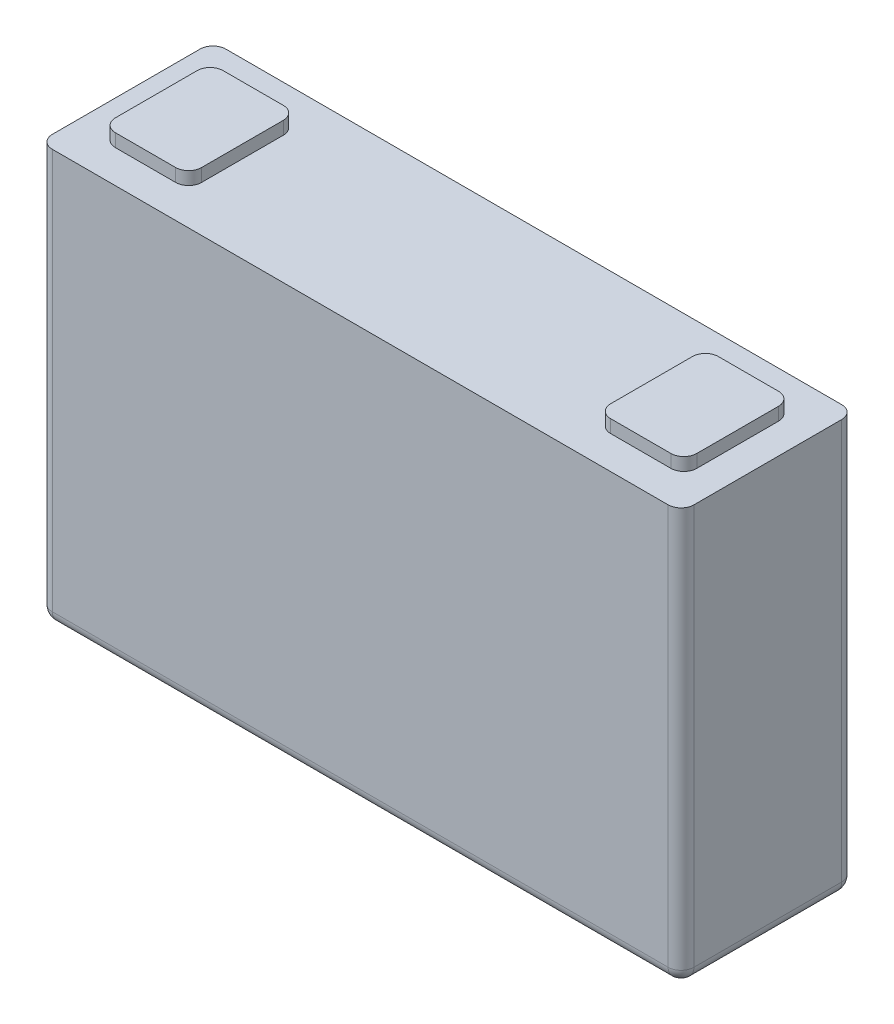
ISO-10303-21;
HEADER;
FILE_DESCRIPTION(('STEP AP214'),'2;1');
FILE_NAME('part.step','',(''),(''),'','','');
FILE_SCHEMA(('AUTOMOTIVE_DESIGN { 1 0 10303 214 1 1 1 1 }'));
ENDSEC;
DATA;
#1=APPLICATION_CONTEXT('core data for automotive mechanical design processes');
#2=APPLICATION_PROTOCOL_DEFINITION('international standard','automotive_design',2000,#1);
#3=PRODUCT_CONTEXT('',#1,'mechanical');
#4=PRODUCT('Part','Part','',(#3));
#5=PRODUCT_RELATED_PRODUCT_CATEGORY('part','',(#4));
#6=PRODUCT_DEFINITION_FORMATION('','',#4);
#7=PRODUCT_DEFINITION_CONTEXT('part definition',#1,'design');
#8=PRODUCT_DEFINITION('design','',#6,#7);
#9=PRODUCT_DEFINITION_SHAPE('','',#8);
#10=(LENGTH_UNIT() NAMED_UNIT(*) SI_UNIT(.MILLI.,.METRE.));
#11=(NAMED_UNIT(*) PLANE_ANGLE_UNIT() SI_UNIT($,.RADIAN.));
#12=(NAMED_UNIT(*) SI_UNIT($,.STERADIAN.) SOLID_ANGLE_UNIT());
#13=UNCERTAINTY_MEASURE_WITH_UNIT(LENGTH_MEASURE(1.E-05),#10,'distance_accuracy_value','');
#14=(GEOMETRIC_REPRESENTATION_CONTEXT(3) GLOBAL_UNCERTAINTY_ASSIGNED_CONTEXT((#13)) GLOBAL_UNIT_ASSIGNED_CONTEXT((#10,
#11,#12)) REPRESENTATION_CONTEXT('',''));
#15=CARTESIAN_POINT('',(0.,0.,0.));
#16=DIRECTION('',(0.,0.,1.));
#17=DIRECTION('',(1.,0.,0.));
#18=AXIS2_PLACEMENT_3D('',#15,#16,#17);
#19=CARTESIAN_POINT('',(-74.5,48.,20.15));
#20=DIRECTION('',(0.,-1.,0.));
#21=DIRECTION('',(1.,0.,0.));
#22=AXIS2_PLACEMENT_3D('',#19,#20,#21);
#23=PLANE('',#22);
#24=DIRECTION('',(0.,0.,1.));
#25=VECTOR('',#24,1.);
#26=CARTESIAN_POINT('',(-67.5,48.,20.15));
#27=LINE('',#26,#25);
#28=CARTESIAN_POINT('',(-67.5,48.,-9.5));
#29=VERTEX_POINT('',#28);
#30=CARTESIAN_POINT('',(-67.5,48.,9.5));
#31=VERTEX_POINT('',#30);
#32=EDGE_CURVE('E258',#29,#31,#27,.T.);
#33=ORIENTED_EDGE('',*,*,#32,.F.);
#34=CARTESIAN_POINT('',(-64.5,48.,-9.5));
#35=DIRECTION('',(0.,-1.,0.));
#36=DIRECTION('',(1.,0.,0.));
#37=AXIS2_PLACEMENT_3D('',#34,#35,#36);
#38=CIRCLE('',#37,3.);
#39=CARTESIAN_POINT('',(-64.5,48.,-12.5));
#40=VERTEX_POINT('',#39);
#41=EDGE_CURVE('E11',#29,#40,#38,.T.);
#42=ORIENTED_EDGE('',*,*,#41,.T.);
#43=DIRECTION('',(-1.,0.,0.));
#44=VECTOR('',#43,1.);
#45=CARTESIAN_POINT('',(-74.5,48.,-12.5));
#46=LINE('',#45,#44);
#47=CARTESIAN_POINT('',(-50.5,48.,-12.5));
#48=VERTEX_POINT('',#47);
#49=EDGE_CURVE('E250',#48,#40,#46,.T.);
#50=ORIENTED_EDGE('',*,*,#49,.F.);
#51=CARTESIAN_POINT('',(-50.5,48.,-9.5));
#52=DIRECTION('',(0.,-1.,0.));
#53=DIRECTION('',(1.,0.,0.));
#54=AXIS2_PLACEMENT_3D('',#51,#52,#53);
#55=CIRCLE('',#54,3.);
#56=CARTESIAN_POINT('',(-47.5,48.,-9.5));
#57=VERTEX_POINT('',#56);
#58=EDGE_CURVE('E44',#48,#57,#55,.T.);
#59=ORIENTED_EDGE('',*,*,#58,.T.);
#60=DIRECTION('',(0.,0.,-1.));
#61=VECTOR('',#60,1.);
#62=CARTESIAN_POINT('',(-47.5,48.,20.15));
#63=LINE('',#62,#61);
#64=CARTESIAN_POINT('',(-47.5,48.,9.5));
#65=VERTEX_POINT('',#64);
#66=EDGE_CURVE('E252',#65,#57,#63,.T.);
#67=ORIENTED_EDGE('',*,*,#66,.F.);
#68=CARTESIAN_POINT('',(-50.5,48.,9.5));
#69=DIRECTION('',(0.,-1.,0.));
#70=DIRECTION('',(1.,0.,0.));
#71=AXIS2_PLACEMENT_3D('',#68,#69,#70);
#72=CIRCLE('',#71,3.);
#73=CARTESIAN_POINT('',(-50.5,48.,12.5));
#74=VERTEX_POINT('',#73);
#75=EDGE_CURVE('E402',#65,#74,#72,.T.);
#76=ORIENTED_EDGE('',*,*,#75,.T.);
#77=DIRECTION('',(1.,0.,0.));
#78=VECTOR('',#77,1.);
#79=CARTESIAN_POINT('',(-74.5,48.,12.5));
#80=LINE('',#79,#78);
#81=CARTESIAN_POINT('',(-64.5,48.,12.5));
#82=VERTEX_POINT('',#81);
#83=EDGE_CURVE('E255',#82,#74,#80,.T.);
#84=ORIENTED_EDGE('',*,*,#83,.F.);
#85=CARTESIAN_POINT('',(-64.5,48.,9.5));
#86=DIRECTION('',(0.,-1.,0.));
#87=DIRECTION('',(1.,0.,0.));
#88=AXIS2_PLACEMENT_3D('',#85,#86,#87);
#89=CIRCLE('',#88,3.);
#90=EDGE_CURVE('E400',#82,#31,#89,.T.);
#91=ORIENTED_EDGE('',*,*,#90,.T.);
#92=EDGE_LOOP('',(#33,#42,#50,#59,#67,#76,#84,#91));
#93=FACE_BOUND('',#92,.T.);
#94=DIRECTION('',(0.,0.,-1.));
#95=VECTOR('',#94,1.);
#96=CARTESIAN_POINT('',(-74.5,48.,20.15));
#97=LINE('',#96,#95);
#98=CARTESIAN_POINT('',(-74.5,48.,17.15));
#99=VERTEX_POINT('',#98);
#100=CARTESIAN_POINT('',(-74.5,48.,-17.15));
#101=VERTEX_POINT('',#100);
#102=EDGE_CURVE('E237',#99,#101,#97,.T.);
#103=ORIENTED_EDGE('',*,*,#102,.F.);
#104=CARTESIAN_POINT('',(-71.5,48.,17.15));
#105=DIRECTION('',(0.,-1.,0.));
#106=DIRECTION('',(1.,0.,0.));
#107=AXIS2_PLACEMENT_3D('',#104,#105,#106);
#108=CIRCLE('',#107,3.);
#109=CARTESIAN_POINT('',(-71.5,48.,20.15));
#110=VERTEX_POINT('',#109);
#111=EDGE_CURVE('E236',#99,#110,#108,.F.);
#112=ORIENTED_EDGE('',*,*,#111,.T.);
#113=DIRECTION('',(-1.,0.,0.));
#114=VECTOR('',#113,1.);
#115=CARTESIAN_POINT('',(-74.5,48.,20.15));
#116=LINE('',#115,#114);
#117=CARTESIAN_POINT('',(71.5,48.,20.15));
#118=VERTEX_POINT('',#117);
#119=EDGE_CURVE('E213',#118,#110,#116,.T.);
#120=ORIENTED_EDGE('',*,*,#119,.F.);
#121=CARTESIAN_POINT('',(71.5,48.,17.15));
#122=DIRECTION('',(0.,-1.,0.));
#123=DIRECTION('',(1.,0.,0.));
#124=AXIS2_PLACEMENT_3D('',#121,#122,#123);
#125=CIRCLE('',#124,3.);
#126=CARTESIAN_POINT('',(74.5,48.,17.15));
#127=VERTEX_POINT('',#126);
#128=EDGE_CURVE('E223',#118,#127,#125,.F.);
#129=ORIENTED_EDGE('',*,*,#128,.T.);
#130=DIRECTION('',(0.,0.,-1.));
#131=VECTOR('',#130,1.);
#132=CARTESIAN_POINT('',(74.5,48.,20.15));
#133=LINE('',#132,#131);
#134=CARTESIAN_POINT('',(74.5,48.,-17.15));
#135=VERTEX_POINT('',#134);
#136=EDGE_CURVE('E241',#127,#135,#133,.T.);
#137=ORIENTED_EDGE('',*,*,#136,.T.);
#138=CARTESIAN_POINT('',(71.5,48.,-17.15));
#139=DIRECTION('',(0.,-1.,0.));
#140=DIRECTION('',(1.,0.,0.));
#141=AXIS2_PLACEMENT_3D('',#138,#139,#140);
#142=CIRCLE('',#141,3.);
#143=CARTESIAN_POINT('',(71.5,48.,-20.15));
#144=VERTEX_POINT('',#143);
#145=EDGE_CURVE('E230',#135,#144,#142,.F.);
#146=ORIENTED_EDGE('',*,*,#145,.T.);
#147=DIRECTION('',(-1.,0.,0.));
#148=VECTOR('',#147,1.);
#149=CARTESIAN_POINT('',(-74.5,48.,-20.15));
#150=LINE('',#149,#148);
#151=CARTESIAN_POINT('',(-71.5,48.,-20.15));
#152=VERTEX_POINT('',#151);
#153=EDGE_CURVE('E238',#144,#152,#150,.T.);
#154=ORIENTED_EDGE('',*,*,#153,.T.);
#155=CARTESIAN_POINT('',(-71.5,48.,-17.15));
#156=DIRECTION('',(0.,-1.,0.));
#157=DIRECTION('',(1.,0.,0.));
#158=AXIS2_PLACEMENT_3D('',#155,#156,#157);
#159=CIRCLE('',#158,3.);
#160=EDGE_CURVE('E278',#152,#101,#159,.F.);
#161=ORIENTED_EDGE('',*,*,#160,.T.);
#162=EDGE_LOOP('',(#103,#112,#120,#129,#137,#146,#154,#161));
#163=FACE_BOUND('',#162,.T.);
#164=DIRECTION('',(0.,0.,-1.));
#165=VECTOR('',#164,1.);
#166=CARTESIAN_POINT('',(67.5,48.,20.15));
#167=LINE('',#166,#165);
#168=CARTESIAN_POINT('',(67.5,48.,9.5));
#169=VERTEX_POINT('',#168);
#170=CARTESIAN_POINT('',(67.5,48.,-9.5));
#171=VERTEX_POINT('',#170);
#172=EDGE_CURVE('E220',#169,#171,#167,.T.);
#173=ORIENTED_EDGE('',*,*,#172,.F.);
#174=CARTESIAN_POINT('',(64.5,48.,9.5));
#175=DIRECTION('',(0.,-1.,0.));
#176=DIRECTION('',(1.,0.,0.));
#177=AXIS2_PLACEMENT_3D('',#174,#175,#176);
#178=CIRCLE('',#177,3.);
#179=CARTESIAN_POINT('',(64.5,48.,12.5));
#180=VERTEX_POINT('',#179);
#181=EDGE_CURVE('E398',#169,#180,#178,.T.);
#182=ORIENTED_EDGE('',*,*,#181,.T.);
#183=DIRECTION('',(1.,0.,0.));
#184=VECTOR('',#183,1.);
#185=CARTESIAN_POINT('',(-74.5,48.,12.5));
#186=LINE('',#185,#184);
#187=CARTESIAN_POINT('',(50.5,48.,12.5));
#188=VERTEX_POINT('',#187);
#189=EDGE_CURVE('E261',#188,#180,#186,.T.);
#190=ORIENTED_EDGE('',*,*,#189,.F.);
#191=CARTESIAN_POINT('',(50.5,48.,9.5));
#192=DIRECTION('',(0.,-1.,0.));
#193=DIRECTION('',(1.,0.,0.));
#194=AXIS2_PLACEMENT_3D('',#191,#192,#193);
#195=CIRCLE('',#194,3.);
#196=CARTESIAN_POINT('',(47.5,48.,9.5));
#197=VERTEX_POINT('',#196);
#198=EDGE_CURVE('E394',#188,#197,#195,.T.);
#199=ORIENTED_EDGE('',*,*,#198,.T.);
#200=DIRECTION('',(0.,0.,1.));
#201=VECTOR('',#200,1.);
#202=CARTESIAN_POINT('',(47.5,48.,20.15));
#203=LINE('',#202,#201);
#204=CARTESIAN_POINT('',(47.5,48.,-9.5));
#205=VERTEX_POINT('',#204);
#206=EDGE_CURVE('E264',#205,#197,#203,.T.);
#207=ORIENTED_EDGE('',*,*,#206,.F.);
#208=CARTESIAN_POINT('',(50.5,48.,-9.5));
#209=DIRECTION('',(0.,-1.,0.));
#210=DIRECTION('',(1.,0.,0.));
#211=AXIS2_PLACEMENT_3D('',#208,#209,#210);
#212=CIRCLE('',#211,3.);
#213=CARTESIAN_POINT('',(50.5,48.,-12.5));
#214=VERTEX_POINT('',#213);
#215=EDGE_CURVE('E392',#205,#214,#212,.T.);
#216=ORIENTED_EDGE('',*,*,#215,.T.);
#217=DIRECTION('',(-1.,0.,0.));
#218=VECTOR('',#217,1.);
#219=CARTESIAN_POINT('',(-74.5,48.,-12.5));
#220=LINE('',#219,#218);
#221=CARTESIAN_POINT('',(64.5,48.,-12.5));
#222=VERTEX_POINT('',#221);
#223=EDGE_CURVE('E267',#222,#214,#220,.T.);
#224=ORIENTED_EDGE('',*,*,#223,.F.);
#225=CARTESIAN_POINT('',(64.5,48.,-9.5));
#226=DIRECTION('',(0.,-1.,0.));
#227=DIRECTION('',(1.,0.,0.));
#228=AXIS2_PLACEMENT_3D('',#225,#226,#227);
#229=CIRCLE('',#228,3.);
#230=EDGE_CURVE('E396',#222,#171,#229,.T.);
#231=ORIENTED_EDGE('',*,*,#230,.T.);
#232=EDGE_LOOP('',(#173,#182,#190,#199,#207,#216,#224,#231));
#233=FACE_BOUND('',#232,.T.);
#234=ADVANCED_FACE('F36',(#93,#163,#233),#23,.F.);
#235=CARTESIAN_POINT('',(-74.5,48.,20.15));
#236=DIRECTION('',(1.,0.,0.));
#237=DIRECTION('',(0.,1.,0.));
#238=AXIS2_PLACEMENT_3D('',#235,#236,#237);
#239=PLANE('',#238);
#240=DIRECTION('',(0.,-1.,0.));
#241=VECTOR('',#240,1.);
#242=CARTESIAN_POINT('',(-74.5,48.,-17.15));
#243=LINE('',#242,#241);
#244=CARTESIAN_POINT('',(-74.5,-45.,-17.15));
#245=VERTEX_POINT('',#244);
#246=EDGE_CURVE('E273',#101,#245,#243,.T.);
#247=ORIENTED_EDGE('',*,*,#246,.T.);
#248=DIRECTION('',(0.,0.,-1.));
#249=VECTOR('',#248,1.);
#250=CARTESIAN_POINT('',(-74.5,-45.,20.15));
#251=LINE('',#250,#249);
#252=CARTESIAN_POINT('',(-74.5,-45.,17.15));
#253=VERTEX_POINT('',#252);
#254=EDGE_CURVE('E312',#245,#253,#251,.F.);
#255=ORIENTED_EDGE('',*,*,#254,.T.);
#256=DIRECTION('',(0.,-1.,0.));
#257=VECTOR('',#256,1.);
#258=CARTESIAN_POINT('',(-74.5,48.,17.15));
#259=LINE('',#258,#257);
#260=EDGE_CURVE('E231',#253,#99,#259,.F.);
#261=ORIENTED_EDGE('',*,*,#260,.T.);
#262=ORIENTED_EDGE('',*,*,#102,.T.);
#263=EDGE_LOOP('',(#247,#255,#261,#262));
#264=FACE_BOUND('',#263,.T.);
#265=ADVANCED_FACE('F484',(#264),#239,.F.);
#266=CARTESIAN_POINT('',(-74.5,-48.,20.15));
#267=DIRECTION('',(0.,1.,0.));
#268=DIRECTION('',(-1.,0.,0.));
#269=AXIS2_PLACEMENT_3D('',#266,#267,#268);
#270=PLANE('',#269);
#271=DIRECTION('',(0.,0.,-1.));
#272=VECTOR('',#271,1.);
#273=CARTESIAN_POINT('',(71.5,-48.,20.15));
#274=LINE('',#273,#272);
#275=CARTESIAN_POINT('',(71.5,-48.,-17.15));
#276=VERTEX_POINT('',#275);
#277=CARTESIAN_POINT('',(71.5,-48.,17.15));
#278=VERTEX_POINT('',#277);
#279=EDGE_CURVE('E297',#276,#278,#274,.F.);
#280=ORIENTED_EDGE('',*,*,#279,.T.);
#281=DIRECTION('',(1.,0.,0.));
#282=VECTOR('',#281,1.);
#283=CARTESIAN_POINT('',(-71.5,-48.,17.15));
#284=LINE('',#283,#282);
#285=CARTESIAN_POINT('',(-71.5,-48.,17.15));
#286=VERTEX_POINT('',#285);
#287=EDGE_CURVE('E299',#278,#286,#284,.F.);
#288=ORIENTED_EDGE('',*,*,#287,.T.);
#289=DIRECTION('',(0.,0.,-1.));
#290=VECTOR('',#289,1.);
#291=CARTESIAN_POINT('',(-71.5,-48.,20.15));
#292=LINE('',#291,#290);
#293=CARTESIAN_POINT('',(-71.5,-48.,-17.15));
#294=VERTEX_POINT('',#293);
#295=EDGE_CURVE('E293',#286,#294,#292,.T.);
#296=ORIENTED_EDGE('',*,*,#295,.T.);
#297=DIRECTION('',(1.,0.,0.));
#298=VECTOR('',#297,1.);
#299=CARTESIAN_POINT('',(-74.5,-48.,-17.15));
#300=LINE('',#299,#298);
#301=EDGE_CURVE('E295',#294,#276,#300,.T.);
#302=ORIENTED_EDGE('',*,*,#301,.T.);
#303=EDGE_LOOP('',(#280,#288,#296,#302));
#304=FACE_BOUND('',#303,.T.);
#305=ADVANCED_FACE('F489',(#304),#270,.F.);
#306=CARTESIAN_POINT('',(74.5,48.,20.15));
#307=DIRECTION('',(-1.,0.,0.));
#308=DIRECTION('',(0.,-1.,0.));
#309=AXIS2_PLACEMENT_3D('',#306,#307,#308);
#310=PLANE('',#309);
#311=DIRECTION('',(0.,1.,0.));
#312=VECTOR('',#311,1.);
#313=CARTESIAN_POINT('',(74.5,-48.,17.15));
#314=LINE('',#313,#312);
#315=CARTESIAN_POINT('',(74.5,-45.,17.15));
#316=VERTEX_POINT('',#315);
#317=EDGE_CURVE('E226',#127,#316,#314,.F.);
#318=ORIENTED_EDGE('',*,*,#317,.T.);
#319=DIRECTION('',(0.,0.,-1.));
#320=VECTOR('',#319,1.);
#321=CARTESIAN_POINT('',(74.5,-45.,20.15));
#322=LINE('',#321,#320);
#323=CARTESIAN_POINT('',(74.5,-45.,-17.15));
#324=VERTEX_POINT('',#323);
#325=EDGE_CURVE('E304',#316,#324,#322,.T.);
#326=ORIENTED_EDGE('',*,*,#325,.T.);
#327=DIRECTION('',(0.,1.,0.));
#328=VECTOR('',#327,1.);
#329=CARTESIAN_POINT('',(74.5,48.,-17.15));
#330=LINE('',#329,#328);
#331=EDGE_CURVE('E287',#324,#135,#330,.T.);
#332=ORIENTED_EDGE('',*,*,#331,.T.);
#333=ORIENTED_EDGE('',*,*,#136,.F.);
#334=EDGE_LOOP('',(#318,#326,#332,#333));
#335=FACE_BOUND('',#334,.T.);
#336=ADVANCED_FACE('F496',(#335),#310,.F.);
#337=CARTESIAN_POINT('',(0.,0.,20.15));
#338=DIRECTION('',(0.,0.,1.));
#339=DIRECTION('',(1.,0.,0.));
#340=AXIS2_PLACEMENT_3D('',#337,#338,#339);
#341=PLANE('',#340);
#342=DIRECTION('',(0.,-1.,0.));
#343=VECTOR('',#342,1.);
#344=CARTESIAN_POINT('',(-71.5,-48.,20.15));
#345=LINE('',#344,#343);
#346=CARTESIAN_POINT('',(-71.5,-45.,20.15));
#347=VERTEX_POINT('',#346);
#348=EDGE_CURVE('E219',#110,#347,#345,.T.);
#349=ORIENTED_EDGE('',*,*,#348,.T.);
#350=DIRECTION('',(1.,0.,0.));
#351=VECTOR('',#350,1.);
#352=CARTESIAN_POINT('',(71.5,-45.,20.15));
#353=LINE('',#352,#351);
#354=CARTESIAN_POINT('',(71.5,-45.,20.15));
#355=VERTEX_POINT('',#354);
#356=EDGE_CURVE('E216',#347,#355,#353,.T.);
#357=ORIENTED_EDGE('',*,*,#356,.T.);
#358=DIRECTION('',(0.,1.,0.));
#359=VECTOR('',#358,1.);
#360=CARTESIAN_POINT('',(71.5,48.,20.15));
#361=LINE('',#360,#359);
#362=EDGE_CURVE('E208',#355,#118,#361,.T.);
#363=ORIENTED_EDGE('',*,*,#362,.T.);
#364=ORIENTED_EDGE('',*,*,#119,.T.);
#365=EDGE_LOOP('',(#349,#357,#363,#364));
#366=FACE_BOUND('',#365,.T.);
#367=ADVANCED_FACE('F211',(#366),#341,.T.);
#368=CARTESIAN_POINT('',(0.,0.,-20.15));
#369=DIRECTION('',(0.,0.,1.));
#370=DIRECTION('',(1.,0.,0.));
#371=AXIS2_PLACEMENT_3D('',#368,#369,#370);
#372=PLANE('',#371);
#373=DIRECTION('',(0.,1.,0.));
#374=VECTOR('',#373,1.);
#375=CARTESIAN_POINT('',(71.5,0.,-20.15));
#376=LINE('',#375,#374);
#377=CARTESIAN_POINT('',(71.5,-45.,-20.15));
#378=VERTEX_POINT('',#377);
#379=EDGE_CURVE('E281',#144,#378,#376,.F.);
#380=ORIENTED_EDGE('',*,*,#379,.T.);
#381=DIRECTION('',(1.,0.,0.));
#382=VECTOR('',#381,1.);
#383=CARTESIAN_POINT('',(0.,-45.,-20.15));
#384=LINE('',#383,#382);
#385=CARTESIAN_POINT('',(-71.5,-45.,-20.15));
#386=VERTEX_POINT('',#385);
#387=EDGE_CURVE('E308',#378,#386,#384,.F.);
#388=ORIENTED_EDGE('',*,*,#387,.T.);
#389=DIRECTION('',(0.,-1.,0.));
#390=VECTOR('',#389,1.);
#391=CARTESIAN_POINT('',(-71.5,0.,-20.15));
#392=LINE('',#391,#390);
#393=EDGE_CURVE('E284',#386,#152,#392,.F.);
#394=ORIENTED_EDGE('',*,*,#393,.T.);
#395=ORIENTED_EDGE('',*,*,#153,.F.);
#396=EDGE_LOOP('',(#380,#388,#394,#395));
#397=FACE_BOUND('',#396,.T.);
#398=ADVANCED_FACE('F494',(#397),#372,.F.);
#399=CARTESIAN_POINT('',(-67.5,51.,-12.5));
#400=DIRECTION('',(1.,0.,0.));
#401=DIRECTION('',(0.,1.,0.));
#402=AXIS2_PLACEMENT_3D('',#399,#400,#401);
#403=PLANE('',#402);
#404=ORIENTED_EDGE('',*,*,#32,.T.);
#405=DIRECTION('',(0.,-1.,0.));
#406=VECTOR('',#405,1.);
#407=CARTESIAN_POINT('',(-67.5,51.,9.5));
#408=LINE('',#407,#406);
#409=CARTESIAN_POINT('',(-67.5,51.,9.5));
#410=VERTEX_POINT('',#409);
#411=EDGE_CURVE('E373',#31,#410,#408,.F.);
#412=ORIENTED_EDGE('',*,*,#411,.T.);
#413=DIRECTION('',(0.,0.,1.));
#414=VECTOR('',#413,1.);
#415=CARTESIAN_POINT('',(-67.5,51.,-12.5));
#416=LINE('',#415,#414);
#417=CARTESIAN_POINT('',(-67.5,51.,-9.5));
#418=VERTEX_POINT('',#417);
#419=EDGE_CURVE('E423',#418,#410,#416,.T.);
#420=ORIENTED_EDGE('',*,*,#419,.F.);
#421=DIRECTION('',(0.,-1.,0.));
#422=VECTOR('',#421,1.);
#423=CARTESIAN_POINT('',(-67.5,51.,-9.5));
#424=LINE('',#423,#422);
#425=EDGE_CURVE('E370',#418,#29,#424,.T.);
#426=ORIENTED_EDGE('',*,*,#425,.T.);
#427=EDGE_LOOP('',(#404,#412,#420,#426));
#428=FACE_BOUND('',#427,.T.);
#429=ADVANCED_FACE('F575',(#428),#403,.F.);
#430=CARTESIAN_POINT('',(-67.5,51.,12.5));
#431=DIRECTION('',(0.,0.,-1.));
#432=DIRECTION('',(-1.,0.,0.));
#433=AXIS2_PLACEMENT_3D('',#430,#431,#432);
#434=PLANE('',#433);
#435=DIRECTION('',(1.,0.,0.));
#436=VECTOR('',#435,1.);
#437=CARTESIAN_POINT('',(-67.5,51.,12.5));
#438=LINE('',#437,#436);
#439=CARTESIAN_POINT('',(-64.5,51.,12.5));
#440=VERTEX_POINT('',#439);
#441=CARTESIAN_POINT('',(-50.5,51.,12.5));
#442=VERTEX_POINT('',#441);
#443=EDGE_CURVE('E421',#440,#442,#438,.T.);
#444=ORIENTED_EDGE('',*,*,#443,.F.);
#445=DIRECTION('',(0.,-1.,0.));
#446=VECTOR('',#445,1.);
#447=CARTESIAN_POINT('',(-64.5,51.,12.5));
#448=LINE('',#447,#446);
#449=EDGE_CURVE('E367',#440,#82,#448,.T.);
#450=ORIENTED_EDGE('',*,*,#449,.T.);
#451=ORIENTED_EDGE('',*,*,#83,.T.);
#452=DIRECTION('',(0.,-1.,0.));
#453=VECTOR('',#452,1.);
#454=CARTESIAN_POINT('',(-50.5,51.,12.5));
#455=LINE('',#454,#453);
#456=EDGE_CURVE('E365',#74,#442,#455,.F.);
#457=ORIENTED_EDGE('',*,*,#456,.T.);
#458=EDGE_LOOP('',(#444,#450,#451,#457));
#459=FACE_BOUND('',#458,.T.);
#460=ADVANCED_FACE('F581',(#459),#434,.F.);
#461=CARTESIAN_POINT('',(-47.5,51.,-12.5));
#462=DIRECTION('',(-1.,0.,0.));
#463=DIRECTION('',(0.,-1.,0.));
#464=AXIS2_PLACEMENT_3D('',#461,#462,#463);
#465=PLANE('',#464);
#466=DIRECTION('',(0.,0.,-1.));
#467=VECTOR('',#466,1.);
#468=CARTESIAN_POINT('',(-47.5,51.,-12.5));
#469=LINE('',#468,#467);
#470=CARTESIAN_POINT('',(-47.5,51.,9.5));
#471=VERTEX_POINT('',#470);
#472=CARTESIAN_POINT('',(-47.5,51.,-9.5));
#473=VERTEX_POINT('',#472);
#474=EDGE_CURVE('E417',#471,#473,#469,.T.);
#475=ORIENTED_EDGE('',*,*,#474,.F.);
#476=DIRECTION('',(0.,-1.,0.));
#477=VECTOR('',#476,1.);
#478=CARTESIAN_POINT('',(-47.5,51.,9.5));
#479=LINE('',#478,#477);
#480=EDGE_CURVE('E385',#471,#65,#479,.T.);
#481=ORIENTED_EDGE('',*,*,#480,.T.);
#482=ORIENTED_EDGE('',*,*,#66,.T.);
#483=DIRECTION('',(0.,-1.,0.));
#484=VECTOR('',#483,1.);
#485=CARTESIAN_POINT('',(-47.5,51.,-9.5));
#486=LINE('',#485,#484);
#487=EDGE_CURVE('E383',#57,#473,#486,.F.);
#488=ORIENTED_EDGE('',*,*,#487,.T.);
#489=EDGE_LOOP('',(#475,#481,#482,#488));
#490=FACE_BOUND('',#489,.T.);
#491=ADVANCED_FACE('F406',(#490),#465,.F.);
#492=CARTESIAN_POINT('',(-67.5,51.,-12.5));
#493=DIRECTION('',(0.,0.,1.));
#494=DIRECTION('',(1.,0.,0.));
#495=AXIS2_PLACEMENT_3D('',#492,#493,#494);
#496=PLANE('',#495);
#497=DIRECTION('',(-1.,0.,0.));
#498=VECTOR('',#497,1.);
#499=CARTESIAN_POINT('',(-67.5,51.,-12.5));
#500=LINE('',#499,#498);
#501=CARTESIAN_POINT('',(-50.5,51.,-12.5));
#502=VERTEX_POINT('',#501);
#503=CARTESIAN_POINT('',(-64.5,51.,-12.5));
#504=VERTEX_POINT('',#503);
#505=EDGE_CURVE('E244',#502,#504,#500,.T.);
#506=ORIENTED_EDGE('',*,*,#505,.F.);
#507=DIRECTION('',(0.,-1.,0.));
#508=VECTOR('',#507,1.);
#509=CARTESIAN_POINT('',(-50.5,51.,-12.5));
#510=LINE('',#509,#508);
#511=EDGE_CURVE('E390',#502,#48,#510,.T.);
#512=ORIENTED_EDGE('',*,*,#511,.T.);
#513=ORIENTED_EDGE('',*,*,#49,.T.);
#514=DIRECTION('',(0.,-1.,0.));
#515=VECTOR('',#514,1.);
#516=CARTESIAN_POINT('',(-64.5,51.,-12.5));
#517=LINE('',#516,#515);
#518=EDGE_CURVE('E388',#40,#504,#517,.F.);
#519=ORIENTED_EDGE('',*,*,#518,.T.);
#520=EDGE_LOOP('',(#506,#512,#513,#519));
#521=FACE_BOUND('',#520,.T.);
#522=ADVANCED_FACE('F419',(#521),#496,.F.);
#523=CARTESIAN_POINT('',(0.,51.,0.));
#524=DIRECTION('',(0.,1.,0.));
#525=DIRECTION('',(0.,0.,1.));
#526=AXIS2_PLACEMENT_3D('',#523,#524,#525);
#527=PLANE('',#526);
#528=ORIENTED_EDGE('',*,*,#419,.T.);
#529=CARTESIAN_POINT('',(-64.5,51.,9.5));
#530=DIRECTION('',(0.,1.,0.));
#531=DIRECTION('',(0.,0.,1.));
#532=AXIS2_PLACEMENT_3D('',#529,#530,#531);
#533=CIRCLE('',#532,3.);
#534=EDGE_CURVE('E381',#410,#440,#533,.T.);
#535=ORIENTED_EDGE('',*,*,#534,.T.);
#536=ORIENTED_EDGE('',*,*,#443,.T.);
#537=CARTESIAN_POINT('',(-50.5,51.,9.5));
#538=DIRECTION('',(0.,1.,0.));
#539=DIRECTION('',(0.,0.,1.));
#540=AXIS2_PLACEMENT_3D('',#537,#538,#539);
#541=CIRCLE('',#540,3.);
#542=EDGE_CURVE('E379',#442,#471,#541,.T.);
#543=ORIENTED_EDGE('',*,*,#542,.T.);
#544=ORIENTED_EDGE('',*,*,#474,.T.);
#545=CARTESIAN_POINT('',(-50.5,51.,-9.5));
#546=DIRECTION('',(0.,1.,0.));
#547=DIRECTION('',(0.,0.,1.));
#548=AXIS2_PLACEMENT_3D('',#545,#546,#547);
#549=CIRCLE('',#548,3.);
#550=EDGE_CURVE('E377',#473,#502,#549,.T.);
#551=ORIENTED_EDGE('',*,*,#550,.T.);
#552=ORIENTED_EDGE('',*,*,#505,.T.);
#553=CARTESIAN_POINT('',(-64.5,51.,-9.5));
#554=DIRECTION('',(0.,1.,0.));
#555=DIRECTION('',(0.,0.,1.));
#556=AXIS2_PLACEMENT_3D('',#553,#554,#555);
#557=CIRCLE('',#556,3.);
#558=EDGE_CURVE('E375',#504,#418,#557,.T.);
#559=ORIENTED_EDGE('',*,*,#558,.T.);
#560=EDGE_LOOP('',(#528,#535,#536,#543,#544,#551,#552,#559));
#561=FACE_BOUND('',#560,.T.);
#562=ADVANCED_FACE('F415',(#561),#527,.T.);
#563=CARTESIAN_POINT('',(67.5,51.,-12.5));
#564=DIRECTION('',(-1.,0.,0.));
#565=DIRECTION('',(0.,-1.,0.));
#566=AXIS2_PLACEMENT_3D('',#563,#564,#565);
#567=PLANE('',#566);
#568=ORIENTED_EDGE('',*,*,#172,.T.);
#569=DIRECTION('',(0.,-1.,0.));
#570=VECTOR('',#569,1.);
#571=CARTESIAN_POINT('',(67.5,51.,-9.5));
#572=LINE('',#571,#570);
#573=CARTESIAN_POINT('',(67.5,51.,-9.5));
#574=VERTEX_POINT('',#573);
#575=EDGE_CURVE('E363',#171,#574,#572,.F.);
#576=ORIENTED_EDGE('',*,*,#575,.T.);
#577=DIRECTION('',(0.,0.,-1.));
#578=VECTOR('',#577,1.);
#579=CARTESIAN_POINT('',(67.5,51.,-12.5));
#580=LINE('',#579,#578);
#581=CARTESIAN_POINT('',(67.5,51.,9.5));
#582=VERTEX_POINT('',#581);
#583=EDGE_CURVE('E337',#582,#574,#580,.T.);
#584=ORIENTED_EDGE('',*,*,#583,.F.);
#585=DIRECTION('',(0.,-1.,0.));
#586=VECTOR('',#585,1.);
#587=CARTESIAN_POINT('',(67.5,51.,9.5));
#588=LINE('',#587,#586);
#589=EDGE_CURVE('E360',#582,#169,#588,.T.);
#590=ORIENTED_EDGE('',*,*,#589,.T.);
#591=EDGE_LOOP('',(#568,#576,#584,#590));
#592=FACE_BOUND('',#591,.T.);
#593=ADVANCED_FACE('F474',(#592),#567,.F.);
#594=CARTESIAN_POINT('',(67.5,51.,-12.5));
#595=DIRECTION('',(0.,0.,1.));
#596=DIRECTION('',(1.,0.,0.));
#597=AXIS2_PLACEMENT_3D('',#594,#595,#596);
#598=PLANE('',#597);
#599=ORIENTED_EDGE('',*,*,#223,.T.);
#600=DIRECTION('',(0.,-1.,0.));
#601=VECTOR('',#600,1.);
#602=CARTESIAN_POINT('',(50.5,51.,-12.5));
#603=LINE('',#602,#601);
#604=CARTESIAN_POINT('',(50.5,51.,-12.5));
#605=VERTEX_POINT('',#604);
#606=EDGE_CURVE('E345',#214,#605,#603,.F.);
#607=ORIENTED_EDGE('',*,*,#606,.T.);
#608=DIRECTION('',(-1.,0.,0.));
#609=VECTOR('',#608,1.);
#610=CARTESIAN_POINT('',(67.5,51.,-12.5));
#611=LINE('',#610,#609);
#612=CARTESIAN_POINT('',(64.5,51.,-12.5));
#613=VERTEX_POINT('',#612);
#614=EDGE_CURVE('E433',#613,#605,#611,.T.);
#615=ORIENTED_EDGE('',*,*,#614,.F.);
#616=DIRECTION('',(0.,-1.,0.));
#617=VECTOR('',#616,1.);
#618=CARTESIAN_POINT('',(64.5,51.,-12.5));
#619=LINE('',#618,#617);
#620=EDGE_CURVE('E342',#613,#222,#619,.T.);
#621=ORIENTED_EDGE('',*,*,#620,.T.);
#622=EDGE_LOOP('',(#599,#607,#615,#621));
#623=FACE_BOUND('',#622,.T.);
#624=ADVANCED_FACE('F451',(#623),#598,.F.);
#625=CARTESIAN_POINT('',(47.5,51.,-12.5));
#626=DIRECTION('',(1.,0.,0.));
#627=DIRECTION('',(0.,1.,0.));
#628=AXIS2_PLACEMENT_3D('',#625,#626,#627);
#629=PLANE('',#628);
#630=DIRECTION('',(0.,0.,1.));
#631=VECTOR('',#630,1.);
#632=CARTESIAN_POINT('',(47.5,51.,-12.5));
#633=LINE('',#632,#631);
#634=CARTESIAN_POINT('',(47.5,51.,-9.5));
#635=VERTEX_POINT('',#634);
#636=CARTESIAN_POINT('',(47.5,51.,9.5));
#637=VERTEX_POINT('',#636);
#638=EDGE_CURVE('E430',#635,#637,#633,.T.);
#639=ORIENTED_EDGE('',*,*,#638,.F.);
#640=DIRECTION('',(0.,-1.,0.));
#641=VECTOR('',#640,1.);
#642=CARTESIAN_POINT('',(47.5,51.,-9.5));
#643=LINE('',#642,#641);
#644=EDGE_CURVE('E339',#635,#205,#643,.T.);
#645=ORIENTED_EDGE('',*,*,#644,.T.);
#646=ORIENTED_EDGE('',*,*,#206,.T.);
#647=DIRECTION('',(0.,-1.,0.));
#648=VECTOR('',#647,1.);
#649=CARTESIAN_POINT('',(47.5,51.,9.5));
#650=LINE('',#649,#648);
#651=EDGE_CURVE('E314',#197,#637,#650,.F.);
#652=ORIENTED_EDGE('',*,*,#651,.T.);
#653=EDGE_LOOP('',(#639,#645,#646,#652));
#654=FACE_BOUND('',#653,.T.);
#655=ADVANCED_FACE('F461',(#654),#629,.F.);
#656=CARTESIAN_POINT('',(67.5,51.,12.5));
#657=DIRECTION('',(0.,0.,-1.));
#658=DIRECTION('',(-1.,0.,0.));
#659=AXIS2_PLACEMENT_3D('',#656,#657,#658);
#660=PLANE('',#659);
#661=DIRECTION('',(1.,0.,0.));
#662=VECTOR('',#661,1.);
#663=CARTESIAN_POINT('',(67.5,51.,12.5));
#664=LINE('',#663,#662);
#665=CARTESIAN_POINT('',(50.5,51.,12.5));
#666=VERTEX_POINT('',#665);
#667=CARTESIAN_POINT('',(64.5,51.,12.5));
#668=VERTEX_POINT('',#667);
#669=EDGE_CURVE('E427',#666,#668,#664,.T.);
#670=ORIENTED_EDGE('',*,*,#669,.F.);
#671=DIRECTION('',(0.,-1.,0.));
#672=VECTOR('',#671,1.);
#673=CARTESIAN_POINT('',(50.5,51.,12.5));
#674=LINE('',#673,#672);
#675=EDGE_CURVE('E357',#666,#188,#674,.T.);
#676=ORIENTED_EDGE('',*,*,#675,.T.);
#677=ORIENTED_EDGE('',*,*,#189,.T.);
#678=DIRECTION('',(0.,-1.,0.));
#679=VECTOR('',#678,1.);
#680=CARTESIAN_POINT('',(64.5,51.,12.5));
#681=LINE('',#680,#679);
#682=EDGE_CURVE('E355',#180,#668,#681,.F.);
#683=ORIENTED_EDGE('',*,*,#682,.T.);
#684=EDGE_LOOP('',(#670,#676,#677,#683));
#685=FACE_BOUND('',#684,.T.);
#686=ADVANCED_FACE('F470',(#685),#660,.F.);
#687=CARTESIAN_POINT('',(0.,51.,0.));
#688=DIRECTION('',(0.,-1.,0.));
#689=DIRECTION('',(0.,0.,-1.));
#690=AXIS2_PLACEMENT_3D('',#687,#688,#689);
#691=PLANE('',#690);
#692=ORIENTED_EDGE('',*,*,#614,.T.);
#693=CARTESIAN_POINT('',(50.5,51.,-9.5));
#694=DIRECTION('',(0.,-1.,0.));
#695=DIRECTION('',(0.,0.,-1.));
#696=AXIS2_PLACEMENT_3D('',#693,#694,#695);
#697=CIRCLE('',#696,3.);
#698=EDGE_CURVE('E353',#605,#635,#697,.F.);
#699=ORIENTED_EDGE('',*,*,#698,.T.);
#700=ORIENTED_EDGE('',*,*,#638,.T.);
#701=CARTESIAN_POINT('',(50.5,51.,9.5));
#702=DIRECTION('',(0.,-1.,0.));
#703=DIRECTION('',(0.,0.,-1.));
#704=AXIS2_PLACEMENT_3D('',#701,#702,#703);
#705=CIRCLE('',#704,3.);
#706=EDGE_CURVE('E351',#637,#666,#705,.F.);
#707=ORIENTED_EDGE('',*,*,#706,.T.);
#708=ORIENTED_EDGE('',*,*,#669,.T.);
#709=CARTESIAN_POINT('',(64.5,51.,9.5));
#710=DIRECTION('',(0.,-1.,0.));
#711=DIRECTION('',(0.,0.,-1.));
#712=AXIS2_PLACEMENT_3D('',#709,#710,#711);
#713=CIRCLE('',#712,3.);
#714=EDGE_CURVE('E347',#668,#582,#713,.F.);
#715=ORIENTED_EDGE('',*,*,#714,.T.);
#716=ORIENTED_EDGE('',*,*,#583,.T.);
#717=CARTESIAN_POINT('',(64.5,51.,-9.5));
#718=DIRECTION('',(0.,-1.,0.));
#719=DIRECTION('',(0.,0.,-1.));
#720=AXIS2_PLACEMENT_3D('',#717,#718,#719);
#721=CIRCLE('',#720,3.);
#722=EDGE_CURVE('E349',#574,#613,#721,.F.);
#723=ORIENTED_EDGE('',*,*,#722,.T.);
#724=EDGE_LOOP('',(#692,#699,#700,#707,#708,#715,#716,#723));
#725=FACE_BOUND('',#724,.T.);
#726=ADVANCED_FACE('F440',(#725),#691,.F.);
#727=CARTESIAN_POINT('',(-71.5,0.,17.15));
#728=DIRECTION('',(0.,1.,0.));
#729=DIRECTION('',(-1.,0.,0.));
#730=AXIS2_PLACEMENT_3D('',#727,#728,#729);
#731=CYLINDRICAL_SURFACE('',#730,3.);
#732=ORIENTED_EDGE('',*,*,#260,.F.);
#733=CARTESIAN_POINT('',(-71.5,-45.,17.15));
#734=DIRECTION('',(0.,1.,0.));
#735=DIRECTION('',(-1.,0.,0.));
#736=AXIS2_PLACEMENT_3D('',#733,#734,#735);
#737=CIRCLE('',#736,3.);
#738=EDGE_CURVE('E289',#253,#347,#737,.T.);
#739=ORIENTED_EDGE('',*,*,#738,.T.);
#740=ORIENTED_EDGE('',*,*,#348,.F.);
#741=ORIENTED_EDGE('',*,*,#111,.F.);
#742=EDGE_LOOP('',(#732,#739,#740,#741));
#743=FACE_BOUND('',#742,.T.);
#744=ADVANCED_FACE('F503',(#743),#731,.T.);
#745=CARTESIAN_POINT('',(-71.5,48.,-17.15));
#746=DIRECTION('',(0.,-1.,0.));
#747=DIRECTION('',(1.,0.,0.));
#748=AXIS2_PLACEMENT_3D('',#745,#746,#747);
#749=CYLINDRICAL_SURFACE('',#748,3.);
#750=ORIENTED_EDGE('',*,*,#393,.F.);
#751=CARTESIAN_POINT('',(-71.5,-45.,-17.15));
#752=DIRECTION('',(0.,-1.,0.));
#753=DIRECTION('',(1.,0.,0.));
#754=AXIS2_PLACEMENT_3D('',#751,#752,#753);
#755=CIRCLE('',#754,3.);
#756=EDGE_CURVE('E310',#386,#245,#755,.F.);
#757=ORIENTED_EDGE('',*,*,#756,.T.);
#758=ORIENTED_EDGE('',*,*,#246,.F.);
#759=ORIENTED_EDGE('',*,*,#160,.F.);
#760=EDGE_LOOP('',(#750,#757,#758,#759));
#761=FACE_BOUND('',#760,.T.);
#762=ADVANCED_FACE('F506',(#761),#749,.T.);
#763=CARTESIAN_POINT('',(71.5,48.,-17.15));
#764=DIRECTION('',(0.,1.,0.));
#765=DIRECTION('',(-1.,0.,0.));
#766=AXIS2_PLACEMENT_3D('',#763,#764,#765);
#767=CYLINDRICAL_SURFACE('',#766,3.);
#768=ORIENTED_EDGE('',*,*,#331,.F.);
#769=CARTESIAN_POINT('',(71.5,-45.,-17.15));
#770=DIRECTION('',(0.,1.,0.));
#771=DIRECTION('',(-1.,0.,0.));
#772=AXIS2_PLACEMENT_3D('',#769,#770,#771);
#773=CIRCLE('',#772,3.);
#774=EDGE_CURVE('E306',#324,#378,#773,.T.);
#775=ORIENTED_EDGE('',*,*,#774,.T.);
#776=ORIENTED_EDGE('',*,*,#379,.F.);
#777=ORIENTED_EDGE('',*,*,#145,.F.);
#778=EDGE_LOOP('',(#768,#775,#776,#777));
#779=FACE_BOUND('',#778,.T.);
#780=ADVANCED_FACE('F510',(#779),#767,.T.);
#781=CARTESIAN_POINT('',(71.5,0.,17.15));
#782=DIRECTION('',(0.,-1.,0.));
#783=DIRECTION('',(1.,0.,0.));
#784=AXIS2_PLACEMENT_3D('',#781,#782,#783);
#785=CYLINDRICAL_SURFACE('',#784,3.);
#786=ORIENTED_EDGE('',*,*,#362,.F.);
#787=CARTESIAN_POINT('',(71.5,-45.,17.15));
#788=DIRECTION('',(0.,-1.,0.));
#789=DIRECTION('',(1.,0.,0.));
#790=AXIS2_PLACEMENT_3D('',#787,#788,#789);
#791=CIRCLE('',#790,3.);
#792=EDGE_CURVE('E302',#355,#316,#791,.F.);
#793=ORIENTED_EDGE('',*,*,#792,.T.);
#794=ORIENTED_EDGE('',*,*,#317,.F.);
#795=ORIENTED_EDGE('',*,*,#128,.F.);
#796=EDGE_LOOP('',(#786,#793,#794,#795));
#797=FACE_BOUND('',#796,.T.);
#798=ADVANCED_FACE('F224',(#797),#785,.T.);
#799=CARTESIAN_POINT('',(71.5,-45.,-17.15));
#800=DIRECTION('',(0.,1.,0.));
#801=DIRECTION('',(-1.,0.,0.));
#802=AXIS2_PLACEMENT_3D('',#799,#800,#801);
#803=SPHERICAL_SURFACE('',#802,3.);
#804=CARTESIAN_POINT('',(71.5,-45.,-17.15));
#805=DIRECTION('',(-1.,0.,0.));
#806=DIRECTION('',(0.,0.,1.));
#807=AXIS2_PLACEMENT_3D('',#804,#805,#806);
#808=CIRCLE('',#807,3.);
#809=EDGE_CURVE('E331',#378,#276,#808,.T.);
#810=ORIENTED_EDGE('',*,*,#809,.F.);
#811=ORIENTED_EDGE('',*,*,#774,.F.);
#812=CARTESIAN_POINT('',(71.5,-45.,-17.15));
#813=DIRECTION('',(0.,0.,1.));
#814=DIRECTION('',(1.,0.,0.));
#815=AXIS2_PLACEMENT_3D('',#812,#813,#814);
#816=CIRCLE('',#815,3.);
#817=EDGE_CURVE('E334',#276,#324,#816,.T.);
#818=ORIENTED_EDGE('',*,*,#817,.F.);
#819=EDGE_LOOP('',(#810,#811,#818));
#820=FACE_BOUND('',#819,.T.);
#821=ADVANCED_FACE('F517',(#820),#803,.T.);
#822=CARTESIAN_POINT('',(71.5,-45.,20.15));
#823=DIRECTION('',(0.,0.,-1.));
#824=DIRECTION('',(-1.,0.,0.));
#825=AXIS2_PLACEMENT_3D('',#822,#823,#824);
#826=CYLINDRICAL_SURFACE('',#825,3.);
#827=ORIENTED_EDGE('',*,*,#817,.T.);
#828=ORIENTED_EDGE('',*,*,#325,.F.);
#829=CARTESIAN_POINT('',(71.5,-45.,17.15));
#830=DIRECTION('',(0.,0.,1.));
#831=DIRECTION('',(1.,0.,0.));
#832=AXIS2_PLACEMENT_3D('',#829,#830,#831);
#833=CIRCLE('',#832,3.);
#834=EDGE_CURVE('E328',#278,#316,#833,.T.);
#835=ORIENTED_EDGE('',*,*,#834,.F.);
#836=ORIENTED_EDGE('',*,*,#279,.F.);
#837=EDGE_LOOP('',(#827,#828,#835,#836));
#838=FACE_BOUND('',#837,.T.);
#839=ADVANCED_FACE('F541',(#838),#826,.T.);
#840=CARTESIAN_POINT('',(-74.5,-45.,-17.15));
#841=DIRECTION('',(1.,0.,0.));
#842=DIRECTION('',(0.,1.,0.));
#843=AXIS2_PLACEMENT_3D('',#840,#841,#842);
#844=CYLINDRICAL_SURFACE('',#843,3.);
#845=ORIENTED_EDGE('',*,*,#809,.T.);
#846=ORIENTED_EDGE('',*,*,#301,.F.);
#847=CARTESIAN_POINT('',(-71.5,-45.,-17.15));
#848=DIRECTION('',(-1.,0.,0.));
#849=DIRECTION('',(0.,0.,1.));
#850=AXIS2_PLACEMENT_3D('',#847,#848,#849);
#851=CIRCLE('',#850,3.);
#852=EDGE_CURVE('E325',#386,#294,#851,.T.);
#853=ORIENTED_EDGE('',*,*,#852,.F.);
#854=ORIENTED_EDGE('',*,*,#387,.F.);
#855=EDGE_LOOP('',(#845,#846,#853,#854));
#856=FACE_BOUND('',#855,.T.);
#857=ADVANCED_FACE('F537',(#856),#844,.T.);
#858=CARTESIAN_POINT('',(71.5,-45.,17.15));
#859=DIRECTION('',(0.,1.,0.));
#860=DIRECTION('',(-1.,0.,0.));
#861=AXIS2_PLACEMENT_3D('',#858,#859,#860);
#862=SPHERICAL_SURFACE('',#861,3.);
#863=ORIENTED_EDGE('',*,*,#834,.T.);
#864=ORIENTED_EDGE('',*,*,#792,.F.);
#865=CARTESIAN_POINT('',(71.5,-45.,17.15));
#866=DIRECTION('',(-1.,0.,0.));
#867=DIRECTION('',(0.,0.,1.));
#868=AXIS2_PLACEMENT_3D('',#865,#866,#867);
#869=CIRCLE('',#868,3.);
#870=EDGE_CURVE('E322',#278,#355,#869,.T.);
#871=ORIENTED_EDGE('',*,*,#870,.F.);
#872=EDGE_LOOP('',(#863,#864,#871));
#873=FACE_BOUND('',#872,.T.);
#874=ADVANCED_FACE('F533',(#873),#862,.T.);
#875=CARTESIAN_POINT('',(-71.5,-45.,-17.15));
#876=DIRECTION('',(0.,1.,0.));
#877=DIRECTION('',(-1.,0.,0.));
#878=AXIS2_PLACEMENT_3D('',#875,#876,#877);
#879=SPHERICAL_SURFACE('',#878,3.);
#880=ORIENTED_EDGE('',*,*,#756,.F.);
#881=ORIENTED_EDGE('',*,*,#852,.T.);
#882=CARTESIAN_POINT('',(-71.5,-45.,-17.15));
#883=DIRECTION('',(0.,0.,1.));
#884=DIRECTION('',(1.,0.,0.));
#885=AXIS2_PLACEMENT_3D('',#882,#883,#884);
#886=CIRCLE('',#885,3.);
#887=EDGE_CURVE('E319',#245,#294,#886,.T.);
#888=ORIENTED_EDGE('',*,*,#887,.F.);
#889=EDGE_LOOP('',(#880,#881,#888));
#890=FACE_BOUND('',#889,.T.);
#891=ADVANCED_FACE('F529',(#890),#879,.T.);
#892=CARTESIAN_POINT('',(0.,-45.,17.15));
#893=DIRECTION('',(-1.,0.,0.));
#894=DIRECTION('',(0.,-1.,0.));
#895=AXIS2_PLACEMENT_3D('',#892,#893,#894);
#896=CYLINDRICAL_SURFACE('',#895,3.);
#897=ORIENTED_EDGE('',*,*,#870,.T.);
#898=ORIENTED_EDGE('',*,*,#356,.F.);
#899=CARTESIAN_POINT('',(-71.5,-45.,17.15));
#900=DIRECTION('',(-1.,0.,0.));
#901=DIRECTION('',(0.,0.,1.));
#902=AXIS2_PLACEMENT_3D('',#899,#900,#901);
#903=CIRCLE('',#902,3.);
#904=EDGE_CURVE('E317',#286,#347,#903,.T.);
#905=ORIENTED_EDGE('',*,*,#904,.F.);
#906=ORIENTED_EDGE('',*,*,#287,.F.);
#907=EDGE_LOOP('',(#897,#898,#905,#906));
#908=FACE_BOUND('',#907,.T.);
#909=ADVANCED_FACE('F525',(#908),#896,.T.);
#910=CARTESIAN_POINT('',(-71.5,-45.,20.15));
#911=DIRECTION('',(0.,0.,-1.));
#912=DIRECTION('',(-1.,0.,0.));
#913=AXIS2_PLACEMENT_3D('',#910,#911,#912);
#914=CYLINDRICAL_SURFACE('',#913,3.);
#915=ORIENTED_EDGE('',*,*,#887,.T.);
#916=ORIENTED_EDGE('',*,*,#295,.F.);
#917=CARTESIAN_POINT('',(-71.5,-45.,17.15));
#918=DIRECTION('',(0.,0.,1.));
#919=DIRECTION('',(1.,0.,0.));
#920=AXIS2_PLACEMENT_3D('',#917,#918,#919);
#921=CIRCLE('',#920,3.);
#922=EDGE_CURVE('E315',#253,#286,#921,.T.);
#923=ORIENTED_EDGE('',*,*,#922,.F.);
#924=ORIENTED_EDGE('',*,*,#254,.F.);
#925=EDGE_LOOP('',(#915,#916,#923,#924));
#926=FACE_BOUND('',#925,.T.);
#927=ADVANCED_FACE('F521',(#926),#914,.T.);
#928=CARTESIAN_POINT('',(-71.5,-45.,17.15));
#929=DIRECTION('',(0.,1.,0.));
#930=DIRECTION('',(-1.,0.,0.));
#931=AXIS2_PLACEMENT_3D('',#928,#929,#930);
#932=SPHERICAL_SURFACE('',#931,3.);
#933=ORIENTED_EDGE('',*,*,#904,.T.);
#934=ORIENTED_EDGE('',*,*,#738,.F.);
#935=ORIENTED_EDGE('',*,*,#922,.T.);
#936=EDGE_LOOP('',(#933,#934,#935));
#937=FACE_BOUND('',#936,.T.);
#938=ADVANCED_FACE('F518',(#937),#932,.T.);
#939=CARTESIAN_POINT('',(50.5,51.,-9.5));
#940=DIRECTION('',(0.,-1.,0.));
#941=DIRECTION('',(1.,0.,0.));
#942=AXIS2_PLACEMENT_3D('',#939,#940,#941);
#943=CYLINDRICAL_SURFACE('',#942,3.);
#944=ORIENTED_EDGE('',*,*,#698,.F.);
#945=ORIENTED_EDGE('',*,*,#606,.F.);
#946=ORIENTED_EDGE('',*,*,#215,.F.);
#947=ORIENTED_EDGE('',*,*,#644,.F.);
#948=EDGE_LOOP('',(#944,#945,#946,#947));
#949=FACE_BOUND('',#948,.T.);
#950=ADVANCED_FACE('F458',(#949),#943,.T.);
#951=CARTESIAN_POINT('',(50.5,51.,9.5));
#952=DIRECTION('',(0.,-1.,0.));
#953=DIRECTION('',(1.,0.,0.));
#954=AXIS2_PLACEMENT_3D('',#951,#952,#953);
#955=CYLINDRICAL_SURFACE('',#954,3.);
#956=ORIENTED_EDGE('',*,*,#706,.F.);
#957=ORIENTED_EDGE('',*,*,#651,.F.);
#958=ORIENTED_EDGE('',*,*,#198,.F.);
#959=ORIENTED_EDGE('',*,*,#675,.F.);
#960=EDGE_LOOP('',(#956,#957,#958,#959));
#961=FACE_BOUND('',#960,.T.);
#962=ADVANCED_FACE('F467',(#961),#955,.T.);
#963=CARTESIAN_POINT('',(64.5,51.,-9.5));
#964=DIRECTION('',(0.,-1.,0.));
#965=DIRECTION('',(1.,0.,0.));
#966=AXIS2_PLACEMENT_3D('',#963,#964,#965);
#967=CYLINDRICAL_SURFACE('',#966,3.);
#968=ORIENTED_EDGE('',*,*,#722,.F.);
#969=ORIENTED_EDGE('',*,*,#575,.F.);
#970=ORIENTED_EDGE('',*,*,#230,.F.);
#971=ORIENTED_EDGE('',*,*,#620,.F.);
#972=EDGE_LOOP('',(#968,#969,#970,#971));
#973=FACE_BOUND('',#972,.T.);
#974=ADVANCED_FACE('F448',(#973),#967,.T.);
#975=CARTESIAN_POINT('',(64.5,51.,9.5));
#976=DIRECTION('',(0.,-1.,0.));
#977=DIRECTION('',(1.,0.,0.));
#978=AXIS2_PLACEMENT_3D('',#975,#976,#977);
#979=CYLINDRICAL_SURFACE('',#978,3.);
#980=ORIENTED_EDGE('',*,*,#714,.F.);
#981=ORIENTED_EDGE('',*,*,#682,.F.);
#982=ORIENTED_EDGE('',*,*,#181,.F.);
#983=ORIENTED_EDGE('',*,*,#589,.F.);
#984=EDGE_LOOP('',(#980,#981,#982,#983));
#985=FACE_BOUND('',#984,.T.);
#986=ADVANCED_FACE('F473',(#985),#979,.T.);
#987=CARTESIAN_POINT('',(-64.5,51.,9.5));
#988=DIRECTION('',(0.,-1.,0.));
#989=DIRECTION('',(1.,0.,0.));
#990=AXIS2_PLACEMENT_3D('',#987,#988,#989);
#991=CYLINDRICAL_SURFACE('',#990,3.);
#992=ORIENTED_EDGE('',*,*,#534,.F.);
#993=ORIENTED_EDGE('',*,*,#411,.F.);
#994=ORIENTED_EDGE('',*,*,#90,.F.);
#995=ORIENTED_EDGE('',*,*,#449,.F.);
#996=EDGE_LOOP('',(#992,#993,#994,#995));
#997=FACE_BOUND('',#996,.T.);
#998=ADVANCED_FACE('F557',(#997),#991,.T.);
#999=CARTESIAN_POINT('',(-50.5,51.,9.5));
#1000=DIRECTION('',(0.,-1.,0.));
#1001=DIRECTION('',(1.,0.,0.));
#1002=AXIS2_PLACEMENT_3D('',#999,#1000,#1001);
#1003=CYLINDRICAL_SURFACE('',#1002,3.);
#1004=ORIENTED_EDGE('',*,*,#542,.F.);
#1005=ORIENTED_EDGE('',*,*,#456,.F.);
#1006=ORIENTED_EDGE('',*,*,#75,.F.);
#1007=ORIENTED_EDGE('',*,*,#480,.F.);
#1008=EDGE_LOOP('',(#1004,#1005,#1006,#1007));
#1009=FACE_BOUND('',#1008,.T.);
#1010=ADVANCED_FACE('F560',(#1009),#1003,.T.);
#1011=CARTESIAN_POINT('',(-50.5,51.,-9.5));
#1012=DIRECTION('',(0.,-1.,0.));
#1013=DIRECTION('',(1.,0.,0.));
#1014=AXIS2_PLACEMENT_3D('',#1011,#1012,#1013);
#1015=CYLINDRICAL_SURFACE('',#1014,3.);
#1016=ORIENTED_EDGE('',*,*,#550,.F.);
#1017=ORIENTED_EDGE('',*,*,#487,.F.);
#1018=ORIENTED_EDGE('',*,*,#58,.F.);
#1019=ORIENTED_EDGE('',*,*,#511,.F.);
#1020=EDGE_LOOP('',(#1016,#1017,#1018,#1019));
#1021=FACE_BOUND('',#1020,.T.);
#1022=ADVANCED_FACE('F410',(#1021),#1015,.T.);
#1023=CARTESIAN_POINT('',(-64.5,51.,-9.5));
#1024=DIRECTION('',(0.,-1.,0.));
#1025=DIRECTION('',(1.,0.,0.));
#1026=AXIS2_PLACEMENT_3D('',#1023,#1024,#1025);
#1027=CYLINDRICAL_SURFACE('',#1026,3.);
#1028=ORIENTED_EDGE('',*,*,#558,.F.);
#1029=ORIENTED_EDGE('',*,*,#518,.F.);
#1030=ORIENTED_EDGE('',*,*,#41,.F.);
#1031=ORIENTED_EDGE('',*,*,#425,.F.);
#1032=EDGE_LOOP('',(#1028,#1029,#1030,#1031));
#1033=FACE_BOUND('',#1032,.T.);
#1034=ADVANCED_FACE('F38',(#1033),#1027,.T.);
#1035=CLOSED_SHELL('',(#234,#265,#305,#336,#367,#398,#429,#460,#491,#522,#562,#593,#624,#655,
#686,#726,#744,#762,#780,#798,#821,#839,#857,#874,#891,#909,#927,#938,#950,#962,#974,#986,#998,
#1010,#1022,#1034));
#1036=MANIFOLD_SOLID_BREP('B2',#1035);
#1037=ADVANCED_BREP_SHAPE_REPRESENTATION('',(#18,#1036),#14);
#1038=SHAPE_DEFINITION_REPRESENTATION(#9,#1037);
ENDSEC;
END-ISO-10303-21;
